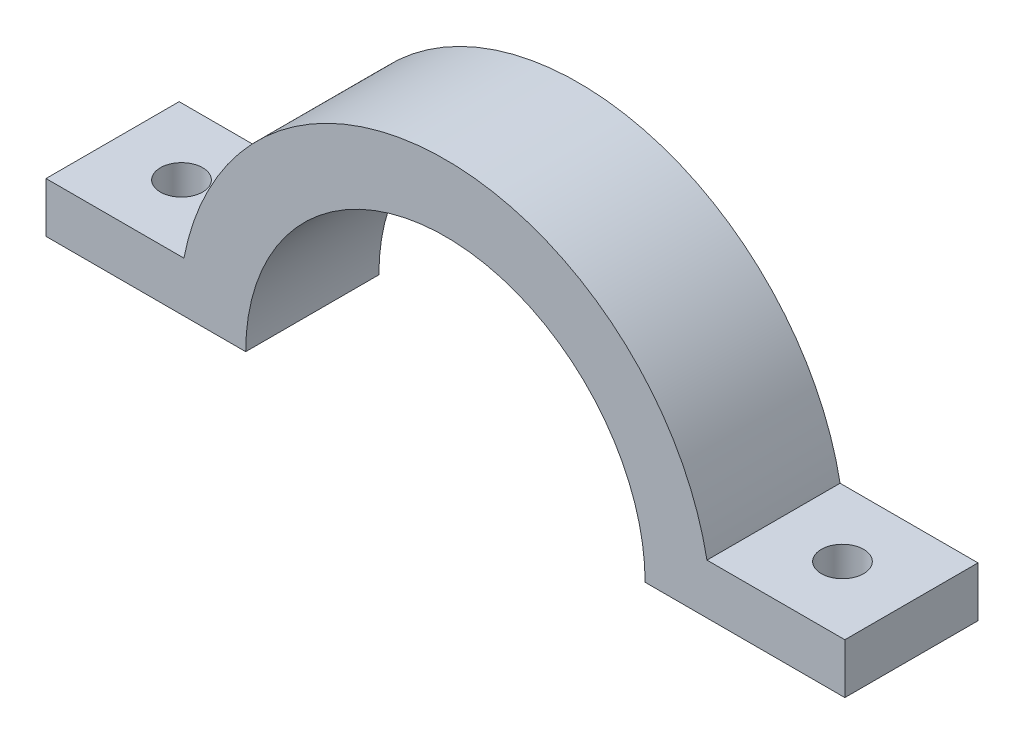
ISO-10303-21;
HEADER;
FILE_DESCRIPTION(('STEP AP214'),'2;1');
FILE_NAME('part.step','',(''),(''),'','','');
FILE_SCHEMA(('AUTOMOTIVE_DESIGN { 1 0 10303 214 1 1 1 1 }'));
ENDSEC;
DATA;
#1=APPLICATION_CONTEXT('core data for automotive mechanical design processes');
#2=APPLICATION_PROTOCOL_DEFINITION('international standard','automotive_design',2000,#1);
#3=PRODUCT_CONTEXT('',#1,'mechanical');
#4=PRODUCT('Part','Part','',(#3));
#5=PRODUCT_RELATED_PRODUCT_CATEGORY('part','',(#4));
#6=PRODUCT_DEFINITION_FORMATION('','',#4);
#7=PRODUCT_DEFINITION_CONTEXT('part definition',#1,'design');
#8=PRODUCT_DEFINITION('design','',#6,#7);
#9=PRODUCT_DEFINITION_SHAPE('','',#8);
#10=(LENGTH_UNIT() NAMED_UNIT(*) SI_UNIT(.MILLI.,.METRE.));
#11=(NAMED_UNIT(*) PLANE_ANGLE_UNIT() SI_UNIT($,.RADIAN.));
#12=(NAMED_UNIT(*) SI_UNIT($,.STERADIAN.) SOLID_ANGLE_UNIT());
#13=UNCERTAINTY_MEASURE_WITH_UNIT(LENGTH_MEASURE(1.E-05),#10,'distance_accuracy_value','');
#14=(GEOMETRIC_REPRESENTATION_CONTEXT(3) GLOBAL_UNCERTAINTY_ASSIGNED_CONTEXT((#13)) GLOBAL_UNIT_ASSIGNED_CONTEXT((#10,
#11,#12)) REPRESENTATION_CONTEXT('',''));
#15=CARTESIAN_POINT('',(0.,0.,0.));
#16=DIRECTION('',(0.,0.,1.));
#17=DIRECTION('',(1.,0.,0.));
#18=AXIS2_PLACEMENT_3D('',#15,#16,#17);
#19=CARTESIAN_POINT('',(-24.8211447123228,-4.49012806053457,5.));
#20=DIRECTION('',(0.,1.,0.));
#21=DIRECTION('',(-1.,0.,0.));
#22=AXIS2_PLACEMENT_3D('',#19,#20,#21);
#23=CYLINDRICAL_SURFACE('',#22,1.5875);
#24=CARTESIAN_POINT('',(-24.8211447123228,3.76569597265335,5.));
#25=DIRECTION('',(0.,1.,0.));
#26=DIRECTION('',(-1.,0.,0.));
#27=AXIS2_PLACEMENT_3D('',#24,#25,#26);
#28=CIRCLE('',#27,1.5875);
#29=CARTESIAN_POINT('',(-26.4086447123228,3.76569597265335,5.));
#30=VERTEX_POINT('',#29);
#31=EDGE_CURVE('E105',#30,#30,#28,.T.);
#32=ORIENTED_EDGE('',*,*,#31,.T.);
#33=EDGE_LOOP('',(#32));
#34=FACE_BOUND('',#33,.T.);
#35=CARTESIAN_POINT('',(-24.8211447123228,0.,5.));
#36=DIRECTION('',(0.,1.,0.));
#37=DIRECTION('',(-1.,0.,0.));
#38=AXIS2_PLACEMENT_3D('',#35,#36,#37);
#39=CIRCLE('',#38,1.5875);
#40=CARTESIAN_POINT('',(-26.4086447123228,0.,5.));
#41=VERTEX_POINT('',#40);
#42=EDGE_CURVE('E20',#41,#41,#39,.F.);
#43=ORIENTED_EDGE('',*,*,#42,.T.);
#44=EDGE_LOOP('',(#43));
#45=FACE_BOUND('',#44,.T.);
#46=ADVANCED_FACE('F17',(#34,#45),#23,.F.);
#47=CARTESIAN_POINT('',(-20.,0.,10.));
#48=DIRECTION('',(0.,1.,0.));
#49=DIRECTION('',(0.,0.,1.));
#50=AXIS2_PLACEMENT_3D('',#47,#48,#49);
#51=PLANE('',#50);
#52=DIRECTION('',(0.,0.,-1.));
#53=VECTOR('',#52,1.);
#54=CARTESIAN_POINT('',(-15.,0.,10.));
#55=LINE('',#54,#53);
#56=CARTESIAN_POINT('',(-15.,0.,0.));
#57=VERTEX_POINT('',#56);
#58=CARTESIAN_POINT('',(-15.,0.,10.));
#59=VERTEX_POINT('',#58);
#60=EDGE_CURVE('E68',#57,#59,#55,.F.);
#61=ORIENTED_EDGE('',*,*,#60,.T.);
#62=DIRECTION('',(-1.,0.,0.));
#63=VECTOR('',#62,1.);
#64=CARTESIAN_POINT('',(0.,0.,10.));
#65=LINE('',#64,#63);
#66=CARTESIAN_POINT('',(-30.,0.,10.));
#67=VERTEX_POINT('',#66);
#68=EDGE_CURVE('E83',#59,#67,#65,.T.);
#69=ORIENTED_EDGE('',*,*,#68,.T.);
#70=DIRECTION('',(0.,0.,-1.));
#71=VECTOR('',#70,1.);
#72=CARTESIAN_POINT('',(-30.,0.,10.));
#73=LINE('',#72,#71);
#74=CARTESIAN_POINT('',(-30.,0.,0.));
#75=VERTEX_POINT('',#74);
#76=EDGE_CURVE('E76',#67,#75,#73,.T.);
#77=ORIENTED_EDGE('',*,*,#76,.T.);
#78=DIRECTION('',(-1.,0.,0.));
#79=VECTOR('',#78,1.);
#80=CARTESIAN_POINT('',(0.,0.,0.));
#81=LINE('',#80,#79);
#82=EDGE_CURVE('E112',#57,#75,#81,.T.);
#83=ORIENTED_EDGE('',*,*,#82,.F.);
#84=EDGE_LOOP('',(#61,#69,#77,#83));
#85=FACE_BOUND('',#84,.T.);
#86=ORIENTED_EDGE('',*,*,#42,.F.);
#87=EDGE_LOOP('',(#86));
#88=FACE_BOUND('',#87,.T.);
#89=ADVANCED_FACE('F225',(#85,#88),#51,.F.);
#90=CARTESIAN_POINT('',(-30.,0.,10.));
#91=DIRECTION('',(1.,0.,0.));
#92=DIRECTION('',(0.,0.,-1.));
#93=AXIS2_PLACEMENT_3D('',#90,#91,#92);
#94=PLANE('',#93);
#95=ORIENTED_EDGE('',*,*,#76,.F.);
#96=DIRECTION('',(0.,1.,0.));
#97=VECTOR('',#96,1.);
#98=CARTESIAN_POINT('',(-30.,0.,10.));
#99=LINE('',#98,#97);
#100=CARTESIAN_POINT('',(-30.,3.76569597265335,10.));
#101=VERTEX_POINT('',#100);
#102=EDGE_CURVE('E89',#67,#101,#99,.T.);
#103=ORIENTED_EDGE('',*,*,#102,.T.);
#104=DIRECTION('',(0.,0.,1.));
#105=VECTOR('',#104,1.);
#106=CARTESIAN_POINT('',(-30.,3.76569597265335,10.));
#107=LINE('',#106,#105);
#108=CARTESIAN_POINT('',(-30.,3.76569597265335,0.));
#109=VERTEX_POINT('',#108);
#110=EDGE_CURVE('E96',#101,#109,#107,.F.);
#111=ORIENTED_EDGE('',*,*,#110,.T.);
#112=DIRECTION('',(0.,1.,0.));
#113=VECTOR('',#112,1.);
#114=CARTESIAN_POINT('',(-30.,0.,0.));
#115=LINE('',#114,#113);
#116=EDGE_CURVE('E99',#75,#109,#115,.T.);
#117=ORIENTED_EDGE('',*,*,#116,.F.);
#118=EDGE_LOOP('',(#95,#103,#111,#117));
#119=FACE_BOUND('',#118,.T.);
#120=ADVANCED_FACE('F98',(#119),#94,.F.);
#121=CARTESIAN_POINT('',(20.,0.,10.));
#122=DIRECTION('',(0.,1.,0.));
#123=DIRECTION('',(0.,0.,1.));
#124=AXIS2_PLACEMENT_3D('',#121,#122,#123);
#125=PLANE('',#124);
#126=DIRECTION('',(0.,0.,1.));
#127=VECTOR('',#126,1.);
#128=CARTESIAN_POINT('',(30.,0.,10.));
#129=LINE('',#128,#127);
#130=CARTESIAN_POINT('',(30.,0.,0.));
#131=VERTEX_POINT('',#130);
#132=CARTESIAN_POINT('',(30.,0.,10.));
#133=VERTEX_POINT('',#132);
#134=EDGE_CURVE('E162',#131,#133,#129,.T.);
#135=ORIENTED_EDGE('',*,*,#134,.T.);
#136=DIRECTION('',(-1.,0.,0.));
#137=VECTOR('',#136,1.);
#138=CARTESIAN_POINT('',(0.,0.,10.));
#139=LINE('',#138,#137);
#140=CARTESIAN_POINT('',(15.,0.,10.));
#141=VERTEX_POINT('',#140);
#142=EDGE_CURVE('E155',#133,#141,#139,.T.);
#143=ORIENTED_EDGE('',*,*,#142,.T.);
#144=DIRECTION('',(0.,0.,-1.));
#145=VECTOR('',#144,1.);
#146=CARTESIAN_POINT('',(15.,0.,10.));
#147=LINE('',#146,#145);
#148=CARTESIAN_POINT('',(15.,0.,0.));
#149=VERTEX_POINT('',#148);
#150=EDGE_CURVE('E62',#141,#149,#147,.T.);
#151=ORIENTED_EDGE('',*,*,#150,.T.);
#152=DIRECTION('',(-1.,0.,0.));
#153=VECTOR('',#152,1.);
#154=CARTESIAN_POINT('',(0.,0.,0.));
#155=LINE('',#154,#153);
#156=EDGE_CURVE('E128',#131,#149,#155,.T.);
#157=ORIENTED_EDGE('',*,*,#156,.F.);
#158=EDGE_LOOP('',(#135,#143,#151,#157));
#159=FACE_BOUND('',#158,.T.);
#160=CARTESIAN_POINT('',(24.8211447123228,0.,5.));
#161=DIRECTION('',(0.,1.,0.));
#162=DIRECTION('',(-1.,0.,0.));
#163=AXIS2_PLACEMENT_3D('',#160,#161,#162);
#164=CIRCLE('',#163,1.5875);
#165=CARTESIAN_POINT('',(23.2336447123228,0.,5.));
#166=VERTEX_POINT('',#165);
#167=EDGE_CURVE('E161',#166,#166,#164,.T.);
#168=ORIENTED_EDGE('',*,*,#167,.T.);
#169=EDGE_LOOP('',(#168));
#170=FACE_BOUND('',#169,.T.);
#171=ADVANCED_FACE('F188',(#159,#170),#125,.F.);
#172=CARTESIAN_POINT('',(0.,0.,10.));
#173=DIRECTION('',(0.,0.,-1.));
#174=DIRECTION('',(-1.,0.,0.));
#175=AXIS2_PLACEMENT_3D('',#172,#173,#174);
#176=CYLINDRICAL_SURFACE('',#175,15.);
#177=ORIENTED_EDGE('',*,*,#150,.F.);
#178=CARTESIAN_POINT('',(0.,0.,10.));
#179=DIRECTION('',(0.,0.,-1.));
#180=DIRECTION('',(-1.,0.,0.));
#181=AXIS2_PLACEMENT_3D('',#178,#179,#180);
#182=CIRCLE('',#181,15.);
#183=EDGE_CURVE('E181',#141,#59,#182,.F.);
#184=ORIENTED_EDGE('',*,*,#183,.T.);
#185=ORIENTED_EDGE('',*,*,#60,.F.);
#186=CARTESIAN_POINT('',(0.,0.,0.));
#187=DIRECTION('',(0.,0.,-1.));
#188=DIRECTION('',(-1.,0.,0.));
#189=AXIS2_PLACEMENT_3D('',#186,#187,#188);
#190=CIRCLE('',#189,15.);
#191=EDGE_CURVE('E134',#149,#57,#190,.F.);
#192=ORIENTED_EDGE('',*,*,#191,.F.);
#193=EDGE_LOOP('',(#177,#184,#185,#192));
#194=FACE_BOUND('',#193,.T.);
#195=ADVANCED_FACE('F194',(#194),#176,.F.);
#196=CARTESIAN_POINT('',(24.8211447123228,-4.49012806053457,5.));
#197=DIRECTION('',(0.,1.,0.));
#198=DIRECTION('',(-1.,0.,0.));
#199=AXIS2_PLACEMENT_3D('',#196,#197,#198);
#200=CYLINDRICAL_SURFACE('',#199,1.5875);
#201=ORIENTED_EDGE('',*,*,#167,.F.);
#202=EDGE_LOOP('',(#201));
#203=FACE_BOUND('',#202,.T.);
#204=CARTESIAN_POINT('',(24.8211447123228,3.76569597265335,5.));
#205=DIRECTION('',(0.,1.,0.));
#206=DIRECTION('',(-1.,0.,0.));
#207=AXIS2_PLACEMENT_3D('',#204,#205,#206);
#208=CIRCLE('',#207,1.5875);
#209=CARTESIAN_POINT('',(23.2336447123228,3.76569597265335,5.));
#210=VERTEX_POINT('',#209);
#211=EDGE_CURVE('E149',#210,#210,#208,.T.);
#212=ORIENTED_EDGE('',*,*,#211,.T.);
#213=EDGE_LOOP('',(#212));
#214=FACE_BOUND('',#213,.T.);
#215=ADVANCED_FACE('F190',(#203,#214),#200,.F.);
#216=CARTESIAN_POINT('',(30.,0.,10.));
#217=DIRECTION('',(-1.,0.,0.));
#218=DIRECTION('',(0.,0.,1.));
#219=AXIS2_PLACEMENT_3D('',#216,#217,#218);
#220=PLANE('',#219);
#221=DIRECTION('',(0.,0.,1.));
#222=VECTOR('',#221,1.);
#223=CARTESIAN_POINT('',(30.,3.76569597265335,10.));
#224=LINE('',#223,#222);
#225=CARTESIAN_POINT('',(30.,3.76569597265335,0.));
#226=VERTEX_POINT('',#225);
#227=CARTESIAN_POINT('',(30.,3.76569597265335,10.));
#228=VERTEX_POINT('',#227);
#229=EDGE_CURVE('E146',#226,#228,#224,.T.);
#230=ORIENTED_EDGE('',*,*,#229,.T.);
#231=DIRECTION('',(0.,1.,0.));
#232=VECTOR('',#231,1.);
#233=CARTESIAN_POINT('',(30.,0.,10.));
#234=LINE('',#233,#232);
#235=EDGE_CURVE('E152',#228,#133,#234,.F.);
#236=ORIENTED_EDGE('',*,*,#235,.T.);
#237=ORIENTED_EDGE('',*,*,#134,.F.);
#238=DIRECTION('',(0.,1.,0.));
#239=VECTOR('',#238,1.);
#240=CARTESIAN_POINT('',(30.,0.,0.));
#241=LINE('',#240,#239);
#242=EDGE_CURVE('E113',#226,#131,#241,.F.);
#243=ORIENTED_EDGE('',*,*,#242,.F.);
#244=EDGE_LOOP('',(#230,#236,#237,#243));
#245=FACE_BOUND('',#244,.T.);
#246=ADVANCED_FACE('F193',(#245),#220,.F.);
#247=CARTESIAN_POINT('',(0.,0.,0.));
#248=DIRECTION('',(0.,0.,-1.));
#249=DIRECTION('',(-1.,0.,0.));
#250=AXIS2_PLACEMENT_3D('',#247,#248,#249);
#251=PLANE('',#250);
#252=ORIENTED_EDGE('',*,*,#242,.T.);
#253=ORIENTED_EDGE('',*,*,#156,.T.);
#254=ORIENTED_EDGE('',*,*,#191,.T.);
#255=ORIENTED_EDGE('',*,*,#82,.T.);
#256=ORIENTED_EDGE('',*,*,#116,.T.);
#257=DIRECTION('',(1.,0.,0.));
#258=VECTOR('',#257,1.);
#259=CARTESIAN_POINT('',(-30.,3.76569597265335,0.));
#260=LINE('',#259,#258);
#261=CARTESIAN_POINT('',(-19.6422894246455,3.76569597265335,0.));
#262=VERTEX_POINT('',#261);
#263=EDGE_CURVE('E104',#109,#262,#260,.T.);
#264=ORIENTED_EDGE('',*,*,#263,.T.);
#265=CARTESIAN_POINT('',(0.,0.,0.));
#266=DIRECTION('',(0.,0.,-1.));
#267=DIRECTION('',(-1.,0.,0.));
#268=AXIS2_PLACEMENT_3D('',#265,#266,#267);
#269=CIRCLE('',#268,20.);
#270=CARTESIAN_POINT('',(19.6422894246455,3.76569597265335,0.));
#271=VERTEX_POINT('',#270);
#272=EDGE_CURVE('E140',#271,#262,#269,.F.);
#273=ORIENTED_EDGE('',*,*,#272,.F.);
#274=DIRECTION('',(1.,0.,0.));
#275=VECTOR('',#274,1.);
#276=CARTESIAN_POINT('',(30.,3.76569597265335,0.));
#277=LINE('',#276,#275);
#278=EDGE_CURVE('E137',#271,#226,#277,.T.);
#279=ORIENTED_EDGE('',*,*,#278,.T.);
#280=EDGE_LOOP('',(#252,#253,#254,#255,#256,#264,#273,#279));
#281=FACE_BOUND('',#280,.T.);
#282=ADVANCED_FACE('F109',(#281),#251,.T.);
#283=CARTESIAN_POINT('',(-30.,3.76569597265335,10.));
#284=DIRECTION('',(0.,-1.,0.));
#285=DIRECTION('',(1.,0.,0.));
#286=AXIS2_PLACEMENT_3D('',#283,#284,#285);
#287=PLANE('',#286);
#288=ORIENTED_EDGE('',*,*,#110,.F.);
#289=DIRECTION('',(-1.,0.,0.));
#290=VECTOR('',#289,1.);
#291=CARTESIAN_POINT('',(0.,3.76569597265335,10.));
#292=LINE('',#291,#290);
#293=CARTESIAN_POINT('',(-19.6422894246455,3.76569597265335,10.));
#294=VERTEX_POINT('',#293);
#295=EDGE_CURVE('E156',#101,#294,#292,.F.);
#296=ORIENTED_EDGE('',*,*,#295,.T.);
#297=DIRECTION('',(0.,0.,-1.));
#298=VECTOR('',#297,1.);
#299=CARTESIAN_POINT('',(-19.6422894246455,3.76569597265335,10.));
#300=LINE('',#299,#298);
#301=EDGE_CURVE('E118',#262,#294,#300,.F.);
#302=ORIENTED_EDGE('',*,*,#301,.F.);
#303=ORIENTED_EDGE('',*,*,#263,.F.);
#304=EDGE_LOOP('',(#288,#296,#302,#303));
#305=FACE_BOUND('',#304,.T.);
#306=ORIENTED_EDGE('',*,*,#31,.F.);
#307=EDGE_LOOP('',(#306));
#308=FACE_BOUND('',#307,.T.);
#309=ADVANCED_FACE('F115',(#305,#308),#287,.F.);
#310=CARTESIAN_POINT('',(0.,0.,10.));
#311=DIRECTION('',(0.,0.,-1.));
#312=DIRECTION('',(-1.,0.,0.));
#313=AXIS2_PLACEMENT_3D('',#310,#311,#312);
#314=PLANE('',#313);
#315=ORIENTED_EDGE('',*,*,#142,.F.);
#316=ORIENTED_EDGE('',*,*,#235,.F.);
#317=DIRECTION('',(1.,0.,0.));
#318=VECTOR('',#317,1.);
#319=CARTESIAN_POINT('',(30.,3.76569597265335,10.));
#320=LINE('',#319,#318);
#321=CARTESIAN_POINT('',(19.6422894246455,3.76569597265335,10.));
#322=VERTEX_POINT('',#321);
#323=EDGE_CURVE('E35',#228,#322,#320,.F.);
#324=ORIENTED_EDGE('',*,*,#323,.T.);
#325=CARTESIAN_POINT('',(0.,0.,10.));
#326=DIRECTION('',(0.,0.,-1.));
#327=DIRECTION('',(-1.,0.,0.));
#328=AXIS2_PLACEMENT_3D('',#325,#326,#327);
#329=CIRCLE('',#328,20.);
#330=EDGE_CURVE('E26',#294,#322,#329,.T.);
#331=ORIENTED_EDGE('',*,*,#330,.F.);
#332=ORIENTED_EDGE('',*,*,#295,.F.);
#333=ORIENTED_EDGE('',*,*,#102,.F.);
#334=ORIENTED_EDGE('',*,*,#68,.F.);
#335=ORIENTED_EDGE('',*,*,#183,.F.);
#336=EDGE_LOOP('',(#315,#316,#324,#331,#332,#333,#334,#335));
#337=FACE_BOUND('',#336,.T.);
#338=ADVANCED_FACE('F201',(#337),#314,.F.);
#339=CARTESIAN_POINT('',(30.,3.76569597265335,10.));
#340=DIRECTION('',(0.,-1.,0.));
#341=DIRECTION('',(1.,0.,0.));
#342=AXIS2_PLACEMENT_3D('',#339,#340,#341);
#343=PLANE('',#342);
#344=DIRECTION('',(0.,0.,-1.));
#345=VECTOR('',#344,1.);
#346=CARTESIAN_POINT('',(19.6422894246455,3.76569597265336,10.));
#347=LINE('',#346,#345);
#348=EDGE_CURVE('E11',#322,#271,#347,.T.);
#349=ORIENTED_EDGE('',*,*,#348,.F.);
#350=ORIENTED_EDGE('',*,*,#323,.F.);
#351=ORIENTED_EDGE('',*,*,#229,.F.);
#352=ORIENTED_EDGE('',*,*,#278,.F.);
#353=EDGE_LOOP('',(#349,#350,#351,#352));
#354=FACE_BOUND('',#353,.T.);
#355=ORIENTED_EDGE('',*,*,#211,.F.);
#356=EDGE_LOOP('',(#355));
#357=FACE_BOUND('',#356,.T.);
#358=ADVANCED_FACE('F198',(#354,#357),#343,.F.);
#359=CARTESIAN_POINT('',(0.,0.,10.));
#360=DIRECTION('',(0.,0.,-1.));
#361=DIRECTION('',(-1.,0.,0.));
#362=AXIS2_PLACEMENT_3D('',#359,#360,#361);
#363=CYLINDRICAL_SURFACE('',#362,20.);
#364=ORIENTED_EDGE('',*,*,#330,.T.);
#365=ORIENTED_EDGE('',*,*,#348,.T.);
#366=ORIENTED_EDGE('',*,*,#272,.T.);
#367=ORIENTED_EDGE('',*,*,#301,.T.);
#368=EDGE_LOOP('',(#364,#365,#366,#367));
#369=FACE_BOUND('',#368,.T.);
#370=ADVANCED_FACE('F200',(#369),#363,.T.);
#371=CLOSED_SHELL('',(#46,#89,#120,#171,#195,#215,#246,#282,#309,#338,#358,#370));
#372=MANIFOLD_SOLID_BREP('B1',#371);
#373=ADVANCED_BREP_SHAPE_REPRESENTATION('',(#18,#372),#14);
#374=SHAPE_DEFINITION_REPRESENTATION(#9,#373);
ENDSEC;
END-ISO-10303-21;
